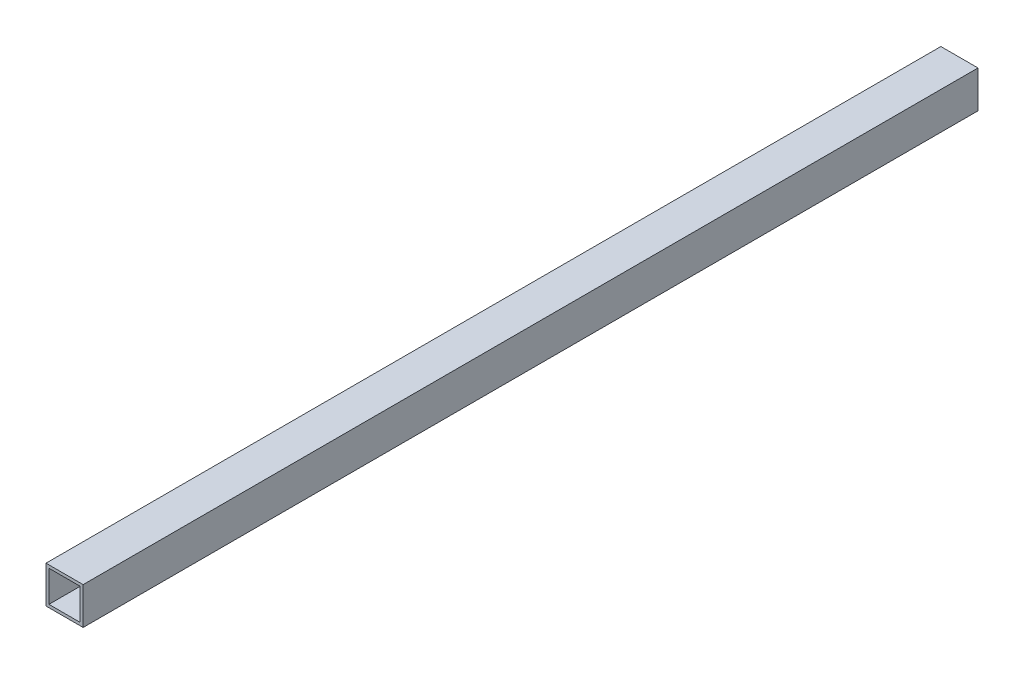
ISO-10303-21;
HEADER;
FILE_DESCRIPTION(('STEP AP214'),'2;1');
FILE_NAME('part.step','',(''),(''),'','','');
FILE_SCHEMA(('AUTOMOTIVE_DESIGN { 1 0 10303 214 1 1 1 1 }'));
ENDSEC;
DATA;
#1=APPLICATION_CONTEXT('core data for automotive mechanical design processes');
#2=APPLICATION_PROTOCOL_DEFINITION('international standard','automotive_design',2000,#1);
#3=PRODUCT_CONTEXT('',#1,'mechanical');
#4=PRODUCT('Part','Part','',(#3));
#5=PRODUCT_RELATED_PRODUCT_CATEGORY('part','',(#4));
#6=PRODUCT_DEFINITION_FORMATION('','',#4);
#7=PRODUCT_DEFINITION_CONTEXT('part definition',#1,'design');
#8=PRODUCT_DEFINITION('design','',#6,#7);
#9=PRODUCT_DEFINITION_SHAPE('','',#8);
#10=(LENGTH_UNIT() NAMED_UNIT(*) SI_UNIT(.MILLI.,.METRE.));
#11=(NAMED_UNIT(*) PLANE_ANGLE_UNIT() SI_UNIT($,.RADIAN.));
#12=(NAMED_UNIT(*) SI_UNIT($,.STERADIAN.) SOLID_ANGLE_UNIT());
#13=UNCERTAINTY_MEASURE_WITH_UNIT(LENGTH_MEASURE(1.E-05),#10,'distance_accuracy_value','');
#14=(GEOMETRIC_REPRESENTATION_CONTEXT(3) GLOBAL_UNCERTAINTY_ASSIGNED_CONTEXT((#13)) GLOBAL_UNIT_ASSIGNED_CONTEXT((#10,
#11,#12)) REPRESENTATION_CONTEXT('',''));
#15=CARTESIAN_POINT('',(0.,0.,0.));
#16=DIRECTION('',(0.,0.,1.));
#17=DIRECTION('',(1.,0.,0.));
#18=AXIS2_PLACEMENT_3D('',#15,#16,#17);
#19=CARTESIAN_POINT('',(0.,0.,612.));
#20=DIRECTION('',(0.,0.,-1.));
#21=DIRECTION('',(-1.,0.,0.));
#22=AXIS2_PLACEMENT_3D('',#19,#20,#21);
#23=PLANE('',#22);
#24=DIRECTION('',(0.,1.,0.));
#25=VECTOR('',#24,1.);
#26=CARTESIAN_POINT('',(12.7,-12.7,612.));
#27=LINE('',#26,#25);
#28=CARTESIAN_POINT('',(12.7,-12.7,612.));
#29=VERTEX_POINT('',#28);
#30=CARTESIAN_POINT('',(12.7,12.7,612.));
#31=VERTEX_POINT('',#30);
#32=EDGE_CURVE('E157',#29,#31,#27,.T.);
#33=ORIENTED_EDGE('',*,*,#32,.T.);
#34=DIRECTION('',(-1.,0.,0.));
#35=VECTOR('',#34,1.);
#36=CARTESIAN_POINT('',(-12.7,12.7,612.));
#37=LINE('',#36,#35);
#38=CARTESIAN_POINT('',(-12.7,12.7,612.));
#39=VERTEX_POINT('',#38);
#40=EDGE_CURVE('E161',#31,#39,#37,.T.);
#41=ORIENTED_EDGE('',*,*,#40,.T.);
#42=DIRECTION('',(0.,-1.,0.));
#43=VECTOR('',#42,1.);
#44=CARTESIAN_POINT('',(-12.7,-12.7,612.));
#45=LINE('',#44,#43);
#46=CARTESIAN_POINT('',(-12.7,-12.7,612.));
#47=VERTEX_POINT('',#46);
#48=EDGE_CURVE('E165',#39,#47,#45,.T.);
#49=ORIENTED_EDGE('',*,*,#48,.T.);
#50=DIRECTION('',(1.,0.,0.));
#51=VECTOR('',#50,1.);
#52=CARTESIAN_POINT('',(-12.7,-12.7,612.));
#53=LINE('',#52,#51);
#54=EDGE_CURVE('E168',#47,#29,#53,.T.);
#55=ORIENTED_EDGE('',*,*,#54,.T.);
#56=EDGE_LOOP('',(#33,#41,#49,#55));
#57=FACE_BOUND('',#56,.T.);
#58=DIRECTION('',(0.,-1.,0.));
#59=VECTOR('',#58,1.);
#60=CARTESIAN_POINT('',(-10.7,-10.7,612.));
#61=LINE('',#60,#59);
#62=CARTESIAN_POINT('',(-10.7,10.7,612.));
#63=VERTEX_POINT('',#62);
#64=CARTESIAN_POINT('',(-10.7,-10.7,612.));
#65=VERTEX_POINT('',#64);
#66=EDGE_CURVE('E109',#63,#65,#61,.T.);
#67=ORIENTED_EDGE('',*,*,#66,.F.);
#68=DIRECTION('',(-1.,0.,0.));
#69=VECTOR('',#68,1.);
#70=CARTESIAN_POINT('',(-10.7,10.7,612.));
#71=LINE('',#70,#69);
#72=CARTESIAN_POINT('',(10.7,10.7,612.));
#73=VERTEX_POINT('',#72);
#74=EDGE_CURVE('E135',#73,#63,#71,.T.);
#75=ORIENTED_EDGE('',*,*,#74,.F.);
#76=DIRECTION('',(0.,1.,0.));
#77=VECTOR('',#76,1.);
#78=CARTESIAN_POINT('',(10.7,-10.7,612.));
#79=LINE('',#78,#77);
#80=CARTESIAN_POINT('',(10.7,-10.7,612.));
#81=VERTEX_POINT('',#80);
#82=EDGE_CURVE('E131',#81,#73,#79,.T.);
#83=ORIENTED_EDGE('',*,*,#82,.F.);
#84=DIRECTION('',(1.,0.,0.));
#85=VECTOR('',#84,1.);
#86=CARTESIAN_POINT('',(-10.7,-10.7,612.));
#87=LINE('',#86,#85);
#88=EDGE_CURVE('E118',#65,#81,#87,.T.);
#89=ORIENTED_EDGE('',*,*,#88,.F.);
#90=EDGE_LOOP('',(#67,#75,#83,#89));
#91=FACE_BOUND('',#90,.T.);
#92=ADVANCED_FACE('F43',(#57,#91),#23,.F.);
#93=CARTESIAN_POINT('',(0.,0.,0.));
#94=DIRECTION('',(0.,0.,-1.));
#95=DIRECTION('',(-1.,0.,0.));
#96=AXIS2_PLACEMENT_3D('',#93,#94,#95);
#97=PLANE('',#96);
#98=DIRECTION('',(0.,1.,0.));
#99=VECTOR('',#98,1.);
#100=CARTESIAN_POINT('',(12.7,-12.7,0.));
#101=LINE('',#100,#99);
#102=CARTESIAN_POINT('',(12.7,-12.7,0.));
#103=VERTEX_POINT('',#102);
#104=CARTESIAN_POINT('',(12.7,12.7,0.));
#105=VERTEX_POINT('',#104);
#106=EDGE_CURVE('E127',#103,#105,#101,.T.);
#107=ORIENTED_EDGE('',*,*,#106,.F.);
#108=DIRECTION('',(1.,0.,0.));
#109=VECTOR('',#108,1.);
#110=CARTESIAN_POINT('',(-12.7,-12.7,0.));
#111=LINE('',#110,#109);
#112=CARTESIAN_POINT('',(-12.7,-12.7,0.));
#113=VERTEX_POINT('',#112);
#114=EDGE_CURVE('E162',#113,#103,#111,.T.);
#115=ORIENTED_EDGE('',*,*,#114,.F.);
#116=DIRECTION('',(0.,-1.,0.));
#117=VECTOR('',#116,1.);
#118=CARTESIAN_POINT('',(-12.7,-12.7,0.));
#119=LINE('',#118,#117);
#120=CARTESIAN_POINT('',(-12.7,12.7,0.));
#121=VERTEX_POINT('',#120);
#122=EDGE_CURVE('E178',#121,#113,#119,.T.);
#123=ORIENTED_EDGE('',*,*,#122,.F.);
#124=DIRECTION('',(-1.,0.,0.));
#125=VECTOR('',#124,1.);
#126=CARTESIAN_POINT('',(-12.7,12.7,0.));
#127=LINE('',#126,#125);
#128=EDGE_CURVE('E175',#105,#121,#127,.T.);
#129=ORIENTED_EDGE('',*,*,#128,.F.);
#130=EDGE_LOOP('',(#107,#115,#123,#129));
#131=FACE_BOUND('',#130,.T.);
#132=DIRECTION('',(-1.,0.,0.));
#133=VECTOR('',#132,1.);
#134=CARTESIAN_POINT('',(-10.7,10.7,0.));
#135=LINE('',#134,#133);
#136=CARTESIAN_POINT('',(10.7,10.7,0.));
#137=VERTEX_POINT('',#136);
#138=CARTESIAN_POINT('',(-10.7,10.7,0.));
#139=VERTEX_POINT('',#138);
#140=EDGE_CURVE('E119',#137,#139,#135,.T.);
#141=ORIENTED_EDGE('',*,*,#140,.T.);
#142=DIRECTION('',(0.,-1.,0.));
#143=VECTOR('',#142,1.);
#144=CARTESIAN_POINT('',(-10.7,-10.7,0.));
#145=LINE('',#144,#143);
#146=CARTESIAN_POINT('',(-10.7,-10.7,0.));
#147=VERTEX_POINT('',#146);
#148=EDGE_CURVE('E67',#139,#147,#145,.T.);
#149=ORIENTED_EDGE('',*,*,#148,.T.);
#150=DIRECTION('',(1.,0.,0.));
#151=VECTOR('',#150,1.);
#152=CARTESIAN_POINT('',(-10.7,-10.7,0.));
#153=LINE('',#152,#151);
#154=CARTESIAN_POINT('',(10.7,-10.7,0.));
#155=VERTEX_POINT('',#154);
#156=EDGE_CURVE('E125',#147,#155,#153,.T.);
#157=ORIENTED_EDGE('',*,*,#156,.T.);
#158=DIRECTION('',(0.,1.,0.));
#159=VECTOR('',#158,1.);
#160=CARTESIAN_POINT('',(10.7,-10.7,0.));
#161=LINE('',#160,#159);
#162=EDGE_CURVE('E144',#155,#137,#161,.T.);
#163=ORIENTED_EDGE('',*,*,#162,.T.);
#164=EDGE_LOOP('',(#141,#149,#157,#163));
#165=FACE_BOUND('',#164,.T.);
#166=ADVANCED_FACE('F201',(#131,#165),#97,.T.);
#167=CARTESIAN_POINT('',(12.7,-12.7,612.));
#168=DIRECTION('',(-1.,0.,0.));
#169=DIRECTION('',(0.,0.,1.));
#170=AXIS2_PLACEMENT_3D('',#167,#168,#169);
#171=PLANE('',#170);
#172=ORIENTED_EDGE('',*,*,#106,.T.);
#173=DIRECTION('',(0.,0.,-1.));
#174=VECTOR('',#173,1.);
#175=CARTESIAN_POINT('',(12.7,12.7,612.));
#176=LINE('',#175,#174);
#177=EDGE_CURVE('E11',#31,#105,#176,.T.);
#178=ORIENTED_EDGE('',*,*,#177,.F.);
#179=ORIENTED_EDGE('',*,*,#32,.F.);
#180=DIRECTION('',(0.,0.,-1.));
#181=VECTOR('',#180,1.);
#182=CARTESIAN_POINT('',(12.7,-12.7,612.));
#183=LINE('',#182,#181);
#184=EDGE_CURVE('E171',#29,#103,#183,.T.);
#185=ORIENTED_EDGE('',*,*,#184,.T.);
#186=EDGE_LOOP('',(#172,#178,#179,#185));
#187=FACE_BOUND('',#186,.T.);
#188=ADVANCED_FACE('F45',(#187),#171,.F.);
#189=CARTESIAN_POINT('',(-12.7,12.7,612.));
#190=DIRECTION('',(0.,-1.,0.));
#191=DIRECTION('',(0.,0.,-1.));
#192=AXIS2_PLACEMENT_3D('',#189,#190,#191);
#193=PLANE('',#192);
#194=ORIENTED_EDGE('',*,*,#128,.T.);
#195=DIRECTION('',(0.,0.,-1.));
#196=VECTOR('',#195,1.);
#197=CARTESIAN_POINT('',(-12.7,12.7,612.));
#198=LINE('',#197,#196);
#199=EDGE_CURVE('E52',#39,#121,#198,.T.);
#200=ORIENTED_EDGE('',*,*,#199,.F.);
#201=ORIENTED_EDGE('',*,*,#40,.F.);
#202=ORIENTED_EDGE('',*,*,#177,.T.);
#203=EDGE_LOOP('',(#194,#200,#201,#202));
#204=FACE_BOUND('',#203,.T.);
#205=ADVANCED_FACE('F211',(#204),#193,.F.);
#206=CARTESIAN_POINT('',(-12.7,-12.7,612.));
#207=DIRECTION('',(1.,0.,0.));
#208=DIRECTION('',(0.,0.,-1.));
#209=AXIS2_PLACEMENT_3D('',#206,#207,#208);
#210=PLANE('',#209);
#211=ORIENTED_EDGE('',*,*,#122,.T.);
#212=DIRECTION('',(0.,0.,-1.));
#213=VECTOR('',#212,1.);
#214=CARTESIAN_POINT('',(-12.7,-12.7,612.));
#215=LINE('',#214,#213);
#216=EDGE_CURVE('E186',#47,#113,#215,.T.);
#217=ORIENTED_EDGE('',*,*,#216,.F.);
#218=ORIENTED_EDGE('',*,*,#48,.F.);
#219=ORIENTED_EDGE('',*,*,#199,.T.);
#220=EDGE_LOOP('',(#211,#217,#218,#219));
#221=FACE_BOUND('',#220,.T.);
#222=ADVANCED_FACE('F195',(#221),#210,.F.);
#223=CARTESIAN_POINT('',(-12.7,-12.7,612.));
#224=DIRECTION('',(0.,1.,0.));
#225=DIRECTION('',(0.,0.,1.));
#226=AXIS2_PLACEMENT_3D('',#223,#224,#225);
#227=PLANE('',#226);
#228=ORIENTED_EDGE('',*,*,#114,.T.);
#229=ORIENTED_EDGE('',*,*,#184,.F.);
#230=ORIENTED_EDGE('',*,*,#54,.F.);
#231=ORIENTED_EDGE('',*,*,#216,.T.);
#232=EDGE_LOOP('',(#228,#229,#230,#231));
#233=FACE_BOUND('',#232,.T.);
#234=ADVANCED_FACE('F205',(#233),#227,.F.);
#235=CARTESIAN_POINT('',(-10.7,-10.7,612.));
#236=DIRECTION('',(1.,0.,0.));
#237=DIRECTION('',(0.,0.,-1.));
#238=AXIS2_PLACEMENT_3D('',#235,#236,#237);
#239=PLANE('',#238);
#240=ORIENTED_EDGE('',*,*,#148,.F.);
#241=DIRECTION('',(0.,0.,-1.));
#242=VECTOR('',#241,1.);
#243=CARTESIAN_POINT('',(-10.7,10.7,612.));
#244=LINE('',#243,#242);
#245=EDGE_CURVE('E113',#63,#139,#244,.T.);
#246=ORIENTED_EDGE('',*,*,#245,.F.);
#247=ORIENTED_EDGE('',*,*,#66,.T.);
#248=DIRECTION('',(0.,0.,-1.));
#249=VECTOR('',#248,1.);
#250=CARTESIAN_POINT('',(-10.7,-10.7,612.));
#251=LINE('',#250,#249);
#252=EDGE_CURVE('E112',#65,#147,#251,.T.);
#253=ORIENTED_EDGE('',*,*,#252,.T.);
#254=EDGE_LOOP('',(#240,#246,#247,#253));
#255=FACE_BOUND('',#254,.T.);
#256=ADVANCED_FACE('F111',(#255),#239,.T.);
#257=CARTESIAN_POINT('',(-10.7,-10.7,612.));
#258=DIRECTION('',(0.,1.,0.));
#259=DIRECTION('',(0.,0.,1.));
#260=AXIS2_PLACEMENT_3D('',#257,#258,#259);
#261=PLANE('',#260);
#262=ORIENTED_EDGE('',*,*,#156,.F.);
#263=ORIENTED_EDGE('',*,*,#252,.F.);
#264=ORIENTED_EDGE('',*,*,#88,.T.);
#265=DIRECTION('',(0.,0.,-1.));
#266=VECTOR('',#265,1.);
#267=CARTESIAN_POINT('',(10.7,-10.7,612.));
#268=LINE('',#267,#266);
#269=EDGE_CURVE('E128',#81,#155,#268,.T.);
#270=ORIENTED_EDGE('',*,*,#269,.T.);
#271=EDGE_LOOP('',(#262,#263,#264,#270));
#272=FACE_BOUND('',#271,.T.);
#273=ADVANCED_FACE('F122',(#272),#261,.T.);
#274=CARTESIAN_POINT('',(10.7,-10.7,612.));
#275=DIRECTION('',(-1.,0.,0.));
#276=DIRECTION('',(0.,0.,1.));
#277=AXIS2_PLACEMENT_3D('',#274,#275,#276);
#278=PLANE('',#277);
#279=ORIENTED_EDGE('',*,*,#162,.F.);
#280=ORIENTED_EDGE('',*,*,#269,.F.);
#281=ORIENTED_EDGE('',*,*,#82,.T.);
#282=DIRECTION('',(0.,0.,-1.));
#283=VECTOR('',#282,1.);
#284=CARTESIAN_POINT('',(10.7,10.7,612.));
#285=LINE('',#284,#283);
#286=EDGE_CURVE('E59',#73,#137,#285,.T.);
#287=ORIENTED_EDGE('',*,*,#286,.T.);
#288=EDGE_LOOP('',(#279,#280,#281,#287));
#289=FACE_BOUND('',#288,.T.);
#290=ADVANCED_FACE('F234',(#289),#278,.T.);
#291=CARTESIAN_POINT('',(-10.7,10.7,612.));
#292=DIRECTION('',(0.,-1.,0.));
#293=DIRECTION('',(0.,0.,-1.));
#294=AXIS2_PLACEMENT_3D('',#291,#292,#293);
#295=PLANE('',#294);
#296=ORIENTED_EDGE('',*,*,#140,.F.);
#297=ORIENTED_EDGE('',*,*,#286,.F.);
#298=ORIENTED_EDGE('',*,*,#74,.T.);
#299=ORIENTED_EDGE('',*,*,#245,.T.);
#300=EDGE_LOOP('',(#296,#297,#298,#299));
#301=FACE_BOUND('',#300,.T.);
#302=ADVANCED_FACE('F238',(#301),#295,.T.);
#303=CLOSED_SHELL('',(#92,#166,#188,#205,#222,#234,#256,#273,#290,#302));
#304=MANIFOLD_SOLID_BREP('B2',#303);
#305=ADVANCED_BREP_SHAPE_REPRESENTATION('',(#18,#304),#14);
#306=SHAPE_DEFINITION_REPRESENTATION(#9,#305);
ENDSEC;
END-ISO-10303-21;
